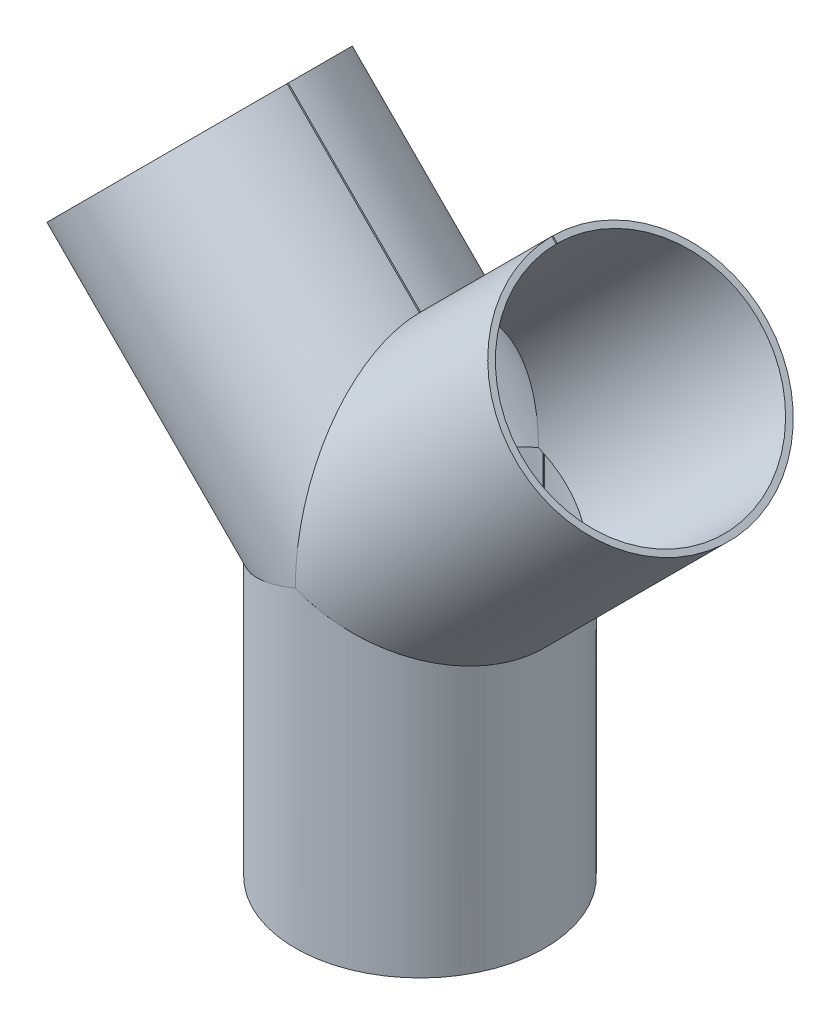
ISO-10303-21;
HEADER;
FILE_DESCRIPTION(('STEP AP214'),'2;1');
FILE_NAME('part.step','',(''),(''),'','','');
FILE_SCHEMA(('AUTOMOTIVE_DESIGN { 1 0 10303 214 1 1 1 1 }'));
ENDSEC;
DATA;
#1=APPLICATION_CONTEXT('core data for automotive mechanical design processes');
#2=APPLICATION_PROTOCOL_DEFINITION('international standard','automotive_design',2000,#1);
#3=PRODUCT_CONTEXT('',#1,'mechanical');
#4=PRODUCT('Part','Part','',(#3));
#5=PRODUCT_RELATED_PRODUCT_CATEGORY('part','',(#4));
#6=PRODUCT_DEFINITION_FORMATION('','',#4);
#7=PRODUCT_DEFINITION_CONTEXT('part definition',#1,'design');
#8=PRODUCT_DEFINITION('design','',#6,#7);
#9=PRODUCT_DEFINITION_SHAPE('','',#8);
#10=(LENGTH_UNIT() NAMED_UNIT(*) SI_UNIT(.MILLI.,.METRE.));
#11=(NAMED_UNIT(*) PLANE_ANGLE_UNIT() SI_UNIT($,.RADIAN.));
#12=(NAMED_UNIT(*) SI_UNIT($,.STERADIAN.) SOLID_ANGLE_UNIT());
#13=UNCERTAINTY_MEASURE_WITH_UNIT(LENGTH_MEASURE(1.E-05),#10,'distance_accuracy_value','');
#14=(GEOMETRIC_REPRESENTATION_CONTEXT(3) GLOBAL_UNCERTAINTY_ASSIGNED_CONTEXT((#13)) GLOBAL_UNIT_ASSIGNED_CONTEXT((#10,
#11,#12)) REPRESENTATION_CONTEXT('',''));
#15=CARTESIAN_POINT('',(0.,0.,0.));
#16=DIRECTION('',(0.,0.,1.));
#17=DIRECTION('',(1.,0.,0.));
#18=AXIS2_PLACEMENT_3D('',#15,#16,#17);
#19=CARTESIAN_POINT('',(0.,0.,0.));
#20=DIRECTION('',(0.,-1.,0.));
#21=DIRECTION('',(1.,0.,0.));
#22=AXIS2_PLACEMENT_3D('',#19,#20,#21);
#23=CYLINDRICAL_SURFACE('',#22,200.);
#24=CARTESIAN_POINT('',(0.,0.,0.));
#25=DIRECTION('',(-0.382683432365084,-0.923879532511289,0.));
#26=DIRECTION('',(0.923879532511289,-0.382683432365084,0.));
#27=AXIS2_PLACEMENT_3D('',#24,#25,#26);
#28=ELLIPSE('',#27,216.478440058478,200.);
#29=CARTESIAN_POINT('',(0.999996874994865,-0.414212267953578,-199.9975));
#30=VERTEX_POINT('',#29);
#31=CARTESIAN_POINT('',(0.,0.,200.));
#32=VERTEX_POINT('',#31);
#33=EDGE_CURVE('E135',#30,#32,#28,.T.);
#34=ORIENTED_EDGE('',*,*,#33,.T.);
#35=CARTESIAN_POINT('',(0.,0.,0.));
#36=DIRECTION('',(0.382683432365084,-0.923879532511289,0.));
#37=DIRECTION('',(-0.923879532511289,-0.382683432365084,0.));
#38=AXIS2_PLACEMENT_3D('',#35,#36,#37);
#39=ELLIPSE('',#38,216.478440058478,200.);
#40=CARTESIAN_POINT('',(-0.999996874995147,-0.414212267953695,-199.9975));
#41=VERTEX_POINT('',#40);
#42=EDGE_CURVE('E138',#32,#41,#39,.T.);
#43=ORIENTED_EDGE('',*,*,#42,.T.);
#44=DIRECTION('',(0.,-1.,0.));
#45=VECTOR('',#44,1.);
#46=CARTESIAN_POINT('',(-0.999996874995147,0.,-199.9975));
#47=LINE('',#46,#45);
#48=CARTESIAN_POINT('',(-0.999996874995055,-500.,-199.9975));
#49=VERTEX_POINT('',#48);
#50=EDGE_CURVE('E102',#41,#49,#47,.T.);
#51=ORIENTED_EDGE('',*,*,#50,.T.);
#52=CARTESIAN_POINT('',(0.,-500.,0.));
#53=DIRECTION('',(0.,1.,0.));
#54=DIRECTION('',(-1.,0.,0.));
#55=AXIS2_PLACEMENT_3D('',#52,#53,#54);
#56=CIRCLE('',#55,200.);
#57=CARTESIAN_POINT('',(0.999996874994957,-500.,-199.9975));
#58=VERTEX_POINT('',#57);
#59=EDGE_CURVE('E151',#49,#58,#56,.T.);
#60=ORIENTED_EDGE('',*,*,#59,.T.);
#61=DIRECTION('',(0.,-1.,0.));
#62=VECTOR('',#61,1.);
#63=CARTESIAN_POINT('',(0.999996874994865,0.,-199.9975));
#64=LINE('',#63,#62);
#65=EDGE_CURVE('E95',#30,#58,#64,.T.);
#66=ORIENTED_EDGE('',*,*,#65,.F.);
#67=EDGE_LOOP('',(#34,#43,#51,#60,#66));
#68=FACE_BOUND('',#67,.T.);
#69=ADVANCED_FACE('F88',(#68),#23,.T.);
#70=CARTESIAN_POINT('',(0.992496898432423,0.,-198.49751875));
#71=DIRECTION('',(-0.9999875,0.,-0.00499998437496119));
#72=DIRECTION('',(-0.00499998437496119,0.,0.9999875));
#73=AXIS2_PLACEMENT_3D('',#70,#71,#72);
#74=PLANE('',#73);
#75=DIRECTION('',(-0.00499997365179152,0.00207105689808014,0.999985355386171));
#76=VECTOR('',#75,1.);
#77=CARTESIAN_POINT('',(0.992492641338627,-0.411103912597948,-198.496667339223));
#78=LINE('',#77,#76);
#79=CARTESIAN_POINT('',(0.992496898432423,-0.411105675943934,-198.49751875));
#80=VERTEX_POINT('',#79);
#81=EDGE_CURVE('E143',#30,#80,#78,.T.);
#82=ORIENTED_EDGE('',*,*,#81,.F.);
#83=ORIENTED_EDGE('',*,*,#65,.T.);
#84=DIRECTION('',(0.00499998437496119,0.,-0.9999875));
#85=VECTOR('',#84,1.);
#86=CARTESIAN_POINT('',(0.992496898432515,-500.,-198.49751875));
#87=LINE('',#86,#85);
#88=CARTESIAN_POINT('',(0.992496898432515,-500.,-198.49751875));
#89=VERTEX_POINT('',#88);
#90=EDGE_CURVE('E154',#89,#58,#87,.T.);
#91=ORIENTED_EDGE('',*,*,#90,.F.);
#92=DIRECTION('',(0.,-1.,0.));
#93=VECTOR('',#92,1.);
#94=CARTESIAN_POINT('',(0.992496898432423,0.,-198.49751875));
#95=LINE('',#94,#93);
#96=EDGE_CURVE('E169',#80,#89,#95,.T.);
#97=ORIENTED_EDGE('',*,*,#96,.F.);
#98=EDGE_LOOP('',(#82,#83,#91,#97));
#99=FACE_BOUND('',#98,.T.);
#100=ADVANCED_FACE('F172',(#99),#74,.T.);
#101=CARTESIAN_POINT('',(0.,0.,0.));
#102=DIRECTION('',(0.,-1.,0.));
#103=DIRECTION('',(1.,0.,0.));
#104=AXIS2_PLACEMENT_3D('',#101,#102,#103);
#105=CYLINDRICAL_SURFACE('',#104,198.5);
#106=CARTESIAN_POINT('',(0.,0.,0.));
#107=DIRECTION('',(-0.382683432365084,-0.923879532511289,0.));
#108=DIRECTION('',(0.923879532511289,-0.382683432365084,0.));
#109=AXIS2_PLACEMENT_3D('',#106,#107,#108);
#110=ELLIPSE('',#109,214.85485175804,198.5);
#111=CARTESIAN_POINT('',(0.,0.,198.5));
#112=VERTEX_POINT('',#111);
#113=EDGE_CURVE('E147',#80,#112,#110,.T.);
#114=ORIENTED_EDGE('',*,*,#113,.F.);
#115=ORIENTED_EDGE('',*,*,#96,.T.);
#116=CARTESIAN_POINT('',(0.,-500.,0.));
#117=DIRECTION('',(0.,1.,0.));
#118=DIRECTION('',(1.,0.,0.));
#119=AXIS2_PLACEMENT_3D('',#116,#117,#118);
#120=CIRCLE('',#119,198.5);
#121=CARTESIAN_POINT('',(-0.992496898432571,-500.,-198.49751875));
#122=VERTEX_POINT('',#121);
#123=EDGE_CURVE('E161',#122,#89,#120,.T.);
#124=ORIENTED_EDGE('',*,*,#123,.F.);
#125=DIRECTION('',(0.,-1.,0.));
#126=VECTOR('',#125,1.);
#127=CARTESIAN_POINT('',(-0.992496898432663,0.,-198.49751875));
#128=LINE('',#127,#126);
#129=CARTESIAN_POINT('',(-0.992496898432663,-0.411105675944034,-198.49751875));
#130=VERTEX_POINT('',#129);
#131=EDGE_CURVE('E110',#130,#122,#128,.T.);
#132=ORIENTED_EDGE('',*,*,#131,.F.);
#133=CARTESIAN_POINT('',(0.,0.,0.));
#134=DIRECTION('',(0.382683432365084,-0.923879532511289,0.));
#135=DIRECTION('',(-0.923879532511289,-0.382683432365084,0.));
#136=AXIS2_PLACEMENT_3D('',#133,#134,#135);
#137=ELLIPSE('',#136,214.85485175804,198.5);
#138=EDGE_CURVE('E152',#112,#130,#137,.T.);
#139=ORIENTED_EDGE('',*,*,#138,.F.);
#140=EDGE_LOOP('',(#114,#115,#124,#132,#139));
#141=FACE_BOUND('',#140,.T.);
#142=ADVANCED_FACE('F177',(#141),#105,.F.);
#143=CARTESIAN_POINT('',(-0.999996874995147,0.,-199.9975));
#144=DIRECTION('',(0.9999875,0.,-0.0049999843749888));
#145=DIRECTION('',(-0.0049999843749888,0.,-0.9999875));
#146=AXIS2_PLACEMENT_3D('',#143,#144,#145);
#147=PLANE('',#146);
#148=DIRECTION('',(-0.00499997365181913,-0.00207105689809158,-0.999985355386171));
#149=VECTOR('',#148,1.);
#150=CARTESIAN_POINT('',(-0.999992585731875,-0.414210491282676,-199.996642155388));
#151=LINE('',#150,#149);
#152=EDGE_CURVE('E142',#130,#41,#151,.T.);
#153=ORIENTED_EDGE('',*,*,#152,.F.);
#154=ORIENTED_EDGE('',*,*,#131,.T.);
#155=DIRECTION('',(0.0049999843749888,0.,0.9999875));
#156=VECTOR('',#155,1.);
#157=CARTESIAN_POINT('',(-0.999996874995055,-500.,-199.9975));
#158=LINE('',#157,#156);
#159=EDGE_CURVE('E164',#49,#122,#158,.T.);
#160=ORIENTED_EDGE('',*,*,#159,.F.);
#161=ORIENTED_EDGE('',*,*,#50,.F.);
#162=EDGE_LOOP('',(#153,#154,#160,#161));
#163=FACE_BOUND('',#162,.T.);
#164=ADVANCED_FACE('F180',(#163),#147,.T.);
#165=CARTESIAN_POINT('',(0.,-500.,0.));
#166=DIRECTION('',(0.,1.,0.));
#167=DIRECTION('',(1.,0.,0.));
#168=AXIS2_PLACEMENT_3D('',#165,#166,#167);
#169=PLANE('',#168);
#170=ORIENTED_EDGE('',*,*,#59,.F.);
#171=ORIENTED_EDGE('',*,*,#159,.T.);
#172=ORIENTED_EDGE('',*,*,#123,.T.);
#173=ORIENTED_EDGE('',*,*,#90,.T.);
#174=EDGE_LOOP('',(#170,#171,#172,#173));
#175=FACE_BOUND('',#174,.T.);
#176=ADVANCED_FACE('F175',(#175),#169,.F.);
#177=CARTESIAN_POINT('',(0.,0.,-200.));
#178=DIRECTION('',(0.382683432365084,-0.923879532511289,0.));
#179=DIRECTION('',(0.923879532511289,0.382683432365084,0.));
#180=AXIS2_PLACEMENT_3D('',#177,#178,#179);
#181=PLANE('',#180);
#182=DIRECTION('',(0.,0.,-1.));
#183=VECTOR('',#182,1.);
#184=CARTESIAN_POINT('',(0.,0.,0.));
#185=LINE('',#184,#183);
#186=EDGE_CURVE('E13',#32,#112,#185,.T.);
#187=ORIENTED_EDGE('',*,*,#186,.T.);
#188=ORIENTED_EDGE('',*,*,#138,.T.);
#189=ORIENTED_EDGE('',*,*,#152,.T.);
#190=ORIENTED_EDGE('',*,*,#42,.F.);
#191=EDGE_LOOP('',(#187,#188,#189,#190));
#192=FACE_BOUND('',#191,.T.);
#193=ADVANCED_FACE('F150',(#192),#181,.F.);
#194=CARTESIAN_POINT('',(0.,0.,-200.));
#195=DIRECTION('',(-0.382683432365084,-0.923879532511289,0.));
#196=DIRECTION('',(0.923879532511289,-0.382683432365084,0.));
#197=AXIS2_PLACEMENT_3D('',#194,#195,#196);
#198=PLANE('',#197);
#199=ORIENTED_EDGE('',*,*,#33,.F.);
#200=ORIENTED_EDGE('',*,*,#81,.T.);
#201=ORIENTED_EDGE('',*,*,#113,.T.);
#202=ORIENTED_EDGE('',*,*,#186,.F.);
#203=EDGE_LOOP('',(#199,#200,#201,#202));
#204=FACE_BOUND('',#203,.T.);
#205=ADVANCED_FACE('F145',(#204),#198,.F.);
#206=CLOSED_SHELL('',(#69,#100,#142,#164,#176,#193,#205));
#207=MANIFOLD_SOLID_BREP('B2',#206);
#208=CARTESIAN_POINT('',(-1.11022302462516E-13,0.,0.));
#209=DIRECTION('',(-0.707106781186549,0.707106781186546,0.));
#210=DIRECTION('',(-0.707106781186546,-0.707106781186549,0.));
#211=AXIS2_PLACEMENT_3D('',#208,#209,#210);
#212=CYLINDRICAL_SURFACE('',#211,200.);
#213=CARTESIAN_POINT('',(0.,0.,0.));
#214=DIRECTION('',(-1.,0.,0.));
#215=DIRECTION('',(0.,1.,0.));
#216=AXIS2_PLACEMENT_3D('',#213,#214,#215);
#217=ELLIPSE('',#216,282.842712474619,200.);
#218=CARTESIAN_POINT('',(0.,282.839176940713,0.9999968749952));
#219=VERTEX_POINT('',#218);
#220=CARTESIAN_POINT('',(0.,0.,200.));
#221=VERTEX_POINT('',#220);
#222=EDGE_CURVE('E327',#219,#221,#217,.F.);
#223=ORIENTED_EDGE('',*,*,#222,.F.);
#224=DIRECTION('',(-0.707106781186549,0.707106781186546,0.));
#225=VECTOR('',#224,1.);
#226=CARTESIAN_POINT('',(141.419588470356,141.419588470357,0.999996874995208));
#227=LINE('',#226,#225);
#228=CARTESIAN_POINT('',(-212.133802122918,494.97297906363,0.999996874995208));
#229=VERTEX_POINT('',#228);
#230=EDGE_CURVE('E342',#219,#229,#227,.T.);
#231=ORIENTED_EDGE('',*,*,#230,.T.);
#232=CARTESIAN_POINT('',(-353.553390593275,353.553390593273,0.));
#233=DIRECTION('',(-0.707106781186549,0.707106781186546,0.));
#234=DIRECTION('',(-0.707106781186546,-0.707106781186549,0.));
#235=AXIS2_PLACEMENT_3D('',#232,#233,#234);
#236=CIRCLE('',#235,200.);
#237=CARTESIAN_POINT('',(-212.133802122918,494.97297906363,-0.99999687499507));
#238=VERTEX_POINT('',#237);
#239=EDGE_CURVE('E329',#238,#229,#236,.T.);
#240=ORIENTED_EDGE('',*,*,#239,.F.);
#241=DIRECTION('',(-0.707106781186549,0.707106781186546,0.));
#242=VECTOR('',#241,1.);
#243=CARTESIAN_POINT('',(141.419588470356,141.419588470357,-0.99999687499507));
#244=LINE('',#243,#242);
#245=CARTESIAN_POINT('',(0.,282.839176940713,-0.999996874995076));
#246=VERTEX_POINT('',#245);
#247=EDGE_CURVE('E264',#246,#238,#244,.T.);
#248=ORIENTED_EDGE('',*,*,#247,.F.);
#249=CARTESIAN_POINT('',(0.,0.,-200.));
#250=VERTEX_POINT('',#249);
#251=EDGE_CURVE('E313',#250,#246,#217,.F.);
#252=ORIENTED_EDGE('',*,*,#251,.F.);
#253=CARTESIAN_POINT('',(0.,0.,0.));
#254=DIRECTION('',(0.382683432365096,-0.923879532511284,0.));
#255=DIRECTION('',(-0.923879532511284,-0.382683432365096,0.));
#256=AXIS2_PLACEMENT_3D('',#253,#254,#255);
#257=ELLIPSE('',#256,216.478440058478,200.);
#258=EDGE_CURVE('E324',#250,#221,#257,.F.);
#259=ORIENTED_EDGE('',*,*,#258,.T.);
#260=EDGE_LOOP('',(#223,#231,#240,#248,#252,#259));
#261=FACE_BOUND('',#260,.T.);
#262=ADVANCED_FACE('F257',(#261),#212,.T.);
#263=CARTESIAN_POINT('',(0.,0.,0.));
#264=DIRECTION('',(-0.707106781186549,0.707106781186546,0.));
#265=DIRECTION('',(-0.707106781186546,-0.707106781186549,0.));
#266=AXIS2_PLACEMENT_3D('',#263,#264,#265);
#267=CYLINDRICAL_SURFACE('',#266,190.);
#268=DIRECTION('',(-0.707106781186549,0.707106781186546,0.));
#269=VECTOR('',#268,1.);
#270=CARTESIAN_POINT('',(134.348609046838,134.348609046839,0.949997031245436));
#271=LINE('',#270,#269);
#272=CARTESIAN_POINT('',(0.,268.697218093677,0.949997031245436));
#273=VERTEX_POINT('',#272);
#274=CARTESIAN_POINT('',(-219.204781546436,487.901999640112,0.949997031245436));
#275=VERTEX_POINT('',#274);
#276=EDGE_CURVE('E345',#273,#275,#271,.T.);
#277=ORIENTED_EDGE('',*,*,#276,.F.);
#278=CARTESIAN_POINT('',(0.,0.,0.));
#279=DIRECTION('',(-1.,0.,0.));
#280=DIRECTION('',(0.,1.,0.));
#281=AXIS2_PLACEMENT_3D('',#278,#279,#280);
#282=ELLIPSE('',#281,268.700576850888,190.);
#283=CARTESIAN_POINT('',(0.,0.,190.));
#284=VERTEX_POINT('',#283);
#285=EDGE_CURVE('E359',#273,#284,#282,.F.);
#286=ORIENTED_EDGE('',*,*,#285,.T.);
#287=CARTESIAN_POINT('',(0.,0.,0.));
#288=DIRECTION('',(0.382683432365096,-0.923879532511284,0.));
#289=DIRECTION('',(-0.923879532511284,-0.382683432365096,0.));
#290=AXIS2_PLACEMENT_3D('',#287,#288,#289);
#291=ELLIPSE('',#290,205.654518055554,190.);
#292=CARTESIAN_POINT('',(0.,0.,-190.));
#293=VERTEX_POINT('',#292);
#294=EDGE_CURVE('E319',#293,#284,#291,.F.);
#295=ORIENTED_EDGE('',*,*,#294,.F.);
#296=CARTESIAN_POINT('',(0.,268.697218093677,-0.949997031245328));
#297=VERTEX_POINT('',#296);
#298=EDGE_CURVE('E314',#293,#297,#282,.F.);
#299=ORIENTED_EDGE('',*,*,#298,.T.);
#300=DIRECTION('',(-0.707106781186549,0.707106781186546,0.));
#301=VECTOR('',#300,1.);
#302=CARTESIAN_POINT('',(134.348609046838,134.348609046839,-0.949997031245328));
#303=LINE('',#302,#301);
#304=CARTESIAN_POINT('',(-219.204781546436,487.901999640112,-0.949997031245328));
#305=VERTEX_POINT('',#304);
#306=EDGE_CURVE('E278',#297,#305,#303,.T.);
#307=ORIENTED_EDGE('',*,*,#306,.T.);
#308=CARTESIAN_POINT('',(-353.553390593274,353.553390593273,0.));
#309=DIRECTION('',(-0.707106781186549,0.707106781186546,0.));
#310=DIRECTION('',(0.,0.,1.));
#311=AXIS2_PLACEMENT_3D('',#308,#309,#310);
#312=CIRCLE('',#311,190.);
#313=EDGE_CURVE('E338',#305,#275,#312,.T.);
#314=ORIENTED_EDGE('',*,*,#313,.T.);
#315=EDGE_LOOP('',(#277,#286,#295,#299,#307,#314));
#316=FACE_BOUND('',#315,.T.);
#317=ADVANCED_FACE('F364',(#316),#267,.F.);
#318=CARTESIAN_POINT('',(141.419588470356,141.419588470357,-0.99999687499507));
#319=DIRECTION('',(-0.00353552285737103,-0.00353552285737104,-0.9999875));
#320=DIRECTION('',(0.,0.999993749941406,-0.00353554495445795));
#321=AXIS2_PLACEMENT_3D('',#318,#319,#320);
#322=PLANE('',#321);
#323=ORIENTED_EDGE('',*,*,#306,.F.);
#324=DIRECTION('',(0.,0.999993749941406,-0.00353554495445795));
#325=VECTOR('',#324,1.);
#326=CARTESIAN_POINT('',(0.,141.421356226261,-0.500004687517184));
#327=LINE('',#326,#325);
#328=EDGE_CURVE('E356',#297,#246,#327,.T.);
#329=ORIENTED_EDGE('',*,*,#328,.T.);
#330=ORIENTED_EDGE('',*,*,#247,.T.);
#331=DIRECTION('',(-0.707097942351781,-0.707097942351784,0.0049999843749742));
#332=VECTOR('',#331,1.);
#333=CARTESIAN_POINT('',(-212.133802122918,494.97297906363,-0.99999687499507));
#334=LINE('',#333,#332);
#335=EDGE_CURVE('E340',#238,#305,#334,.T.);
#336=ORIENTED_EDGE('',*,*,#335,.T.);
#337=EDGE_LOOP('',(#323,#329,#330,#336));
#338=FACE_BOUND('',#337,.T.);
#339=ADVANCED_FACE('F355',(#338),#322,.F.);
#340=CARTESIAN_POINT('',(134.348609046838,134.348609046839,0.949997031245436));
#341=DIRECTION('',(-0.00353552285737315,-0.00353552285737317,0.9999875));
#342=DIRECTION('',(0.,-0.999993749941406,-0.00353554495446008));
#343=AXIS2_PLACEMENT_3D('',#340,#341,#342);
#344=PLANE('',#343);
#345=ORIENTED_EDGE('',*,*,#230,.F.);
#346=DIRECTION('',(0.,-0.999993749941406,-0.00353554495446008));
#347=VECTOR('',#346,1.);
#348=CARTESIAN_POINT('',(0.,134.350288414948,0.475004453141158));
#349=LINE('',#348,#347);
#350=EDGE_CURVE('E362',#219,#273,#349,.T.);
#351=ORIENTED_EDGE('',*,*,#350,.T.);
#352=ORIENTED_EDGE('',*,*,#276,.T.);
#353=DIRECTION('',(0.707097942351781,0.707097942351784,0.0049999843749772));
#354=VECTOR('',#353,1.);
#355=CARTESIAN_POINT('',(-219.204781546436,487.901999640112,0.949997031245436));
#356=LINE('',#355,#354);
#357=EDGE_CURVE('E332',#275,#229,#356,.T.);
#358=ORIENTED_EDGE('',*,*,#357,.T.);
#359=EDGE_LOOP('',(#345,#351,#352,#358));
#360=FACE_BOUND('',#359,.T.);
#361=ADVANCED_FACE('F350',(#360),#344,.F.);
#362=CARTESIAN_POINT('',(-353.553390593275,353.553390593273,0.));
#363=DIRECTION('',(-0.707106781186549,0.707106781186546,0.));
#364=DIRECTION('',(0.,0.,1.));
#365=AXIS2_PLACEMENT_3D('',#362,#363,#364);
#366=PLANE('',#365);
#367=ORIENTED_EDGE('',*,*,#239,.T.);
#368=ORIENTED_EDGE('',*,*,#357,.F.);
#369=ORIENTED_EDGE('',*,*,#313,.F.);
#370=ORIENTED_EDGE('',*,*,#335,.F.);
#371=EDGE_LOOP('',(#367,#368,#369,#370));
#372=FACE_BOUND('',#371,.T.);
#373=ADVANCED_FACE('F354',(#372),#366,.T.);
#374=CARTESIAN_POINT('',(0.,0.,-200.));
#375=DIRECTION('',(0.382683432365096,-0.923879532511284,0.));
#376=DIRECTION('',(0.923879532511284,0.382683432365096,0.));
#377=AXIS2_PLACEMENT_3D('',#374,#375,#376);
#378=PLANE('',#377);
#379=ORIENTED_EDGE('',*,*,#258,.F.);
#380=DIRECTION('',(0.,0.,1.));
#381=VECTOR('',#380,1.);
#382=CARTESIAN_POINT('',(0.,0.,-200.));
#383=LINE('',#382,#381);
#384=EDGE_CURVE('E310',#250,#293,#383,.T.);
#385=ORIENTED_EDGE('',*,*,#384,.T.);
#386=ORIENTED_EDGE('',*,*,#294,.T.);
#387=DIRECTION('',(0.,0.,1.));
#388=VECTOR('',#387,1.);
#389=CARTESIAN_POINT('',(-1.11022302462516E-13,0.,0.));
#390=LINE('',#389,#388);
#391=EDGE_CURVE('E86',#284,#221,#390,.T.);
#392=ORIENTED_EDGE('',*,*,#391,.T.);
#393=EDGE_LOOP('',(#379,#385,#386,#392));
#394=FACE_BOUND('',#393,.T.);
#395=ADVANCED_FACE('F328',(#394),#378,.T.);
#396=CARTESIAN_POINT('',(0.,0.,-200.));
#397=DIRECTION('',(-1.,0.,0.));
#398=DIRECTION('',(0.,0.,1.));
#399=AXIS2_PLACEMENT_3D('',#396,#397,#398);
#400=PLANE('',#399);
#401=ORIENTED_EDGE('',*,*,#251,.T.);
#402=ORIENTED_EDGE('',*,*,#328,.F.);
#403=ORIENTED_EDGE('',*,*,#298,.F.);
#404=ORIENTED_EDGE('',*,*,#384,.F.);
#405=EDGE_LOOP('',(#401,#402,#403,#404));
#406=FACE_BOUND('',#405,.T.);
#407=ADVANCED_FACE('F312',(#406),#400,.F.);
#408=ORIENTED_EDGE('',*,*,#222,.T.);
#409=ORIENTED_EDGE('',*,*,#391,.F.);
#410=ORIENTED_EDGE('',*,*,#285,.F.);
#411=ORIENTED_EDGE('',*,*,#350,.F.);
#412=EDGE_LOOP('',(#408,#409,#410,#411));
#413=FACE_BOUND('',#412,.T.);
#414=ADVANCED_FACE('F365',(#413),#400,.F.);
#415=CLOSED_SHELL('',(#262,#317,#339,#361,#373,#395,#407,#414));
#416=MANIFOLD_SOLID_BREP('B7',#415);
#417=CARTESIAN_POINT('',(0.,0.,0.));
#418=DIRECTION('',(0.707106781186546,0.707106781186549,0.));
#419=DIRECTION('',(-0.707106781186549,0.707106781186546,0.));
#420=AXIS2_PLACEMENT_3D('',#417,#418,#419);
#421=CYLINDRICAL_SURFACE('',#420,200.);
#422=DIRECTION('',(0.707106781186546,0.707106781186549,0.));
#423=VECTOR('',#422,1.);
#424=CARTESIAN_POINT('',(-141.419588470357,141.419588470356,0.999996874995142));
#425=LINE('',#424,#423);
#426=CARTESIAN_POINT('',(0.,282.839176940713,0.999996874995135));
#427=VERTEX_POINT('',#426);
#428=CARTESIAN_POINT('',(212.133802122916,494.972979063631,0.999996874995142));
#429=VERTEX_POINT('',#428);
#430=EDGE_CURVE('E447',#427,#429,#425,.T.);
#431=ORIENTED_EDGE('',*,*,#430,.F.);
#432=CARTESIAN_POINT('',(0.,0.,0.));
#433=DIRECTION('',(-1.,0.,0.));
#434=DIRECTION('',(0.,1.,0.));
#435=AXIS2_PLACEMENT_3D('',#432,#433,#434);
#436=ELLIPSE('',#435,282.84271247462,200.);
#437=CARTESIAN_POINT('',(0.,0.,200.));
#438=VERTEX_POINT('',#437);
#439=EDGE_CURVE('E494',#427,#438,#436,.F.);
#440=ORIENTED_EDGE('',*,*,#439,.T.);
#441=CARTESIAN_POINT('',(0.,0.,0.));
#442=DIRECTION('',(0.382683432365094,0.923879532511285,0.));
#443=DIRECTION('',(0.923879532511285,-0.382683432365094,0.));
#444=AXIS2_PLACEMENT_3D('',#441,#442,#443);
#445=ELLIPSE('',#444,216.478440058478,200.);
#446=CARTESIAN_POINT('',(0.,0.,-200.));
#447=VERTEX_POINT('',#446);
#448=EDGE_CURVE('E503',#447,#438,#445,.F.);
#449=ORIENTED_EDGE('',*,*,#448,.F.);
#450=CARTESIAN_POINT('',(0.,282.839176940713,-0.999996874995052));
#451=VERTEX_POINT('',#450);
#452=EDGE_CURVE('E509',#447,#451,#436,.F.);
#453=ORIENTED_EDGE('',*,*,#452,.T.);
#454=DIRECTION('',(0.707106781186546,0.707106781186549,0.));
#455=VECTOR('',#454,1.);
#456=CARTESIAN_POINT('',(-141.419588470357,141.419588470356,-0.999996874995055));
#457=LINE('',#456,#455);
#458=CARTESIAN_POINT('',(212.133802122916,494.972979063631,-0.999996874995055));
#459=VERTEX_POINT('',#458);
#460=EDGE_CURVE('E526',#451,#459,#457,.T.);
#461=ORIENTED_EDGE('',*,*,#460,.T.);
#462=CARTESIAN_POINT('',(353.553390593273,353.553390593274,0.));
#463=DIRECTION('',(0.707106781186546,0.707106781186549,0.));
#464=DIRECTION('',(-0.707106781186549,0.707106781186546,0.));
#465=AXIS2_PLACEMENT_3D('',#462,#463,#464);
#466=CIRCLE('',#465,200.);
#467=EDGE_CURVE('E511',#429,#459,#466,.T.);
#468=ORIENTED_EDGE('',*,*,#467,.F.);
#469=EDGE_LOOP('',(#431,#440,#449,#453,#461,#468));
#470=FACE_BOUND('',#469,.T.);
#471=ADVANCED_FACE('F440',(#470),#421,.T.);
#472=CARTESIAN_POINT('',(-141.419588470357,141.419588470356,0.999996874995142));
#473=DIRECTION('',(0.00353552285737691,-0.0035355228573769,0.9999875));
#474=DIRECTION('',(0.999993749941406,0.,-0.00353554495446382));
#475=AXIS2_PLACEMENT_3D('',#472,#473,#474);
#476=PLANE('',#475);
#477=DIRECTION('',(0.,-0.999993749941406,-0.00353554495446381));
#478=VECTOR('',#477,1.);
#479=CARTESIAN_POINT('',(0.,141.421356226261,0.500004687516422));
#480=LINE('',#479,#478);
#481=CARTESIAN_POINT('',(0.,268.697218093678,0.949997031245317));
#482=VERTEX_POINT('',#481);
#483=EDGE_CURVE('E507',#427,#482,#480,.T.);
#484=ORIENTED_EDGE('',*,*,#483,.F.);
#485=ORIENTED_EDGE('',*,*,#430,.T.);
#486=DIRECTION('',(0.707097942351784,-0.707097942351782,-0.00499998437498249));
#487=VECTOR('',#486,1.);
#488=CARTESIAN_POINT('',(212.133802122916,494.972979063631,0.999996874995142));
#489=LINE('',#488,#487);
#490=CARTESIAN_POINT('',(219.204781546434,487.901999640113,0.949997031245317));
#491=VERTEX_POINT('',#490);
#492=EDGE_CURVE('E524',#429,#491,#489,.T.);
#493=ORIENTED_EDGE('',*,*,#492,.T.);
#494=DIRECTION('',(0.707106781186546,0.707106781186549,0.));
#495=VECTOR('',#494,1.);
#496=CARTESIAN_POINT('',(-134.348609046839,134.348609046838,0.949997031245317));
#497=LINE('',#496,#495);
#498=EDGE_CURVE('E461',#482,#491,#497,.T.);
#499=ORIENTED_EDGE('',*,*,#498,.F.);
#500=EDGE_LOOP('',(#484,#485,#493,#499));
#501=FACE_BOUND('',#500,.T.);
#502=ADVANCED_FACE('F539',(#501),#476,.F.);
#503=CARTESIAN_POINT('',(0.,0.,0.));
#504=DIRECTION('',(0.707106781186546,0.707106781186549,0.));
#505=DIRECTION('',(-0.707106781186549,0.707106781186546,0.));
#506=AXIS2_PLACEMENT_3D('',#503,#504,#505);
#507=CYLINDRICAL_SURFACE('',#506,190.);
#508=CARTESIAN_POINT('',(0.,0.,0.));
#509=DIRECTION('',(-1.,0.,0.));
#510=DIRECTION('',(0.,1.,0.));
#511=AXIS2_PLACEMENT_3D('',#508,#509,#510);
#512=ELLIPSE('',#511,268.700576850889,190.);
#513=CARTESIAN_POINT('',(0.,0.,190.));
#514=VERTEX_POINT('',#513);
#515=EDGE_CURVE('E495',#482,#514,#512,.F.);
#516=ORIENTED_EDGE('',*,*,#515,.F.);
#517=ORIENTED_EDGE('',*,*,#498,.T.);
#518=CARTESIAN_POINT('',(353.553390593273,353.553390593274,0.));
#519=DIRECTION('',(0.707106781186546,0.707106781186549,0.));
#520=DIRECTION('',(0.707106781186549,-0.707106781186546,0.));
#521=AXIS2_PLACEMENT_3D('',#518,#519,#520);
#522=CIRCLE('',#521,190.);
#523=CARTESIAN_POINT('',(219.204781546434,487.901999640113,-0.949997031245279));
#524=VERTEX_POINT('',#523);
#525=EDGE_CURVE('E522',#491,#524,#522,.T.);
#526=ORIENTED_EDGE('',*,*,#525,.T.);
#527=DIRECTION('',(0.707106781186546,0.707106781186549,0.));
#528=VECTOR('',#527,1.);
#529=CARTESIAN_POINT('',(-134.348609046839,134.348609046838,-0.949997031245279));
#530=LINE('',#529,#528);
#531=CARTESIAN_POINT('',(0.,268.697218093678,-0.949997031245279));
#532=VERTEX_POINT('',#531);
#533=EDGE_CURVE('E529',#532,#524,#530,.T.);
#534=ORIENTED_EDGE('',*,*,#533,.F.);
#535=CARTESIAN_POINT('',(0.,0.,-190.));
#536=VERTEX_POINT('',#535);
#537=EDGE_CURVE('E542',#536,#532,#512,.F.);
#538=ORIENTED_EDGE('',*,*,#537,.F.);
#539=CARTESIAN_POINT('',(0.,0.,0.));
#540=DIRECTION('',(0.382683432365094,0.923879532511285,0.));
#541=DIRECTION('',(0.923879532511285,-0.382683432365094,0.));
#542=AXIS2_PLACEMENT_3D('',#539,#540,#541);
#543=ELLIPSE('',#542,205.654518055554,190.);
#544=EDGE_CURVE('E512',#536,#514,#543,.F.);
#545=ORIENTED_EDGE('',*,*,#544,.T.);
#546=EDGE_LOOP('',(#516,#517,#526,#534,#538,#545));
#547=FACE_BOUND('',#546,.T.);
#548=ADVANCED_FACE('F546',(#547),#507,.F.);
#549=CARTESIAN_POINT('',(-134.348609046839,134.348609046838,-0.949997031245279));
#550=DIRECTION('',(0.00353552285737346,-0.00353552285737345,-0.9999875));
#551=DIRECTION('',(-0.999993749941406,0.,-0.00353554495446037));
#552=AXIS2_PLACEMENT_3D('',#549,#550,#551);
#553=PLANE('',#552);
#554=DIRECTION('',(0.,0.999993749941406,-0.00353554495446036));
#555=VECTOR('',#554,1.);
#556=CARTESIAN_POINT('',(0.,134.350288414948,-0.475004453140958));
#557=LINE('',#556,#555);
#558=EDGE_CURVE('E547',#532,#451,#557,.T.);
#559=ORIENTED_EDGE('',*,*,#558,.F.);
#560=ORIENTED_EDGE('',*,*,#533,.T.);
#561=DIRECTION('',(-0.707097942351784,0.707097942351782,-0.00499998437497761));
#562=VECTOR('',#561,1.);
#563=CARTESIAN_POINT('',(219.204781546434,487.901999640113,-0.949997031245279));
#564=LINE('',#563,#562);
#565=EDGE_CURVE('E515',#524,#459,#564,.T.);
#566=ORIENTED_EDGE('',*,*,#565,.T.);
#567=ORIENTED_EDGE('',*,*,#460,.F.);
#568=EDGE_LOOP('',(#559,#560,#566,#567));
#569=FACE_BOUND('',#568,.T.);
#570=ADVANCED_FACE('F534',(#569),#553,.F.);
#571=CARTESIAN_POINT('',(353.553390593273,353.553390593274,0.));
#572=DIRECTION('',(0.707106781186546,0.707106781186549,0.));
#573=DIRECTION('',(0.707106781186549,-0.707106781186546,0.));
#574=AXIS2_PLACEMENT_3D('',#571,#572,#573);
#575=PLANE('',#574);
#576=ORIENTED_EDGE('',*,*,#467,.T.);
#577=ORIENTED_EDGE('',*,*,#565,.F.);
#578=ORIENTED_EDGE('',*,*,#525,.F.);
#579=ORIENTED_EDGE('',*,*,#492,.F.);
#580=EDGE_LOOP('',(#576,#577,#578,#579));
#581=FACE_BOUND('',#580,.T.);
#582=ADVANCED_FACE('F538',(#581),#575,.T.);
#583=CARTESIAN_POINT('',(0.,0.,-200.));
#584=DIRECTION('',(0.382683432365094,0.923879532511285,0.));
#585=DIRECTION('',(-0.923879532511285,0.382683432365094,0.));
#586=AXIS2_PLACEMENT_3D('',#583,#584,#585);
#587=PLANE('',#586);
#588=ORIENTED_EDGE('',*,*,#448,.T.);
#589=DIRECTION('',(0.,0.,1.));
#590=VECTOR('',#589,1.);
#591=CARTESIAN_POINT('',(0.,0.,0.));
#592=LINE('',#591,#590);
#593=EDGE_CURVE('E255',#514,#438,#592,.T.);
#594=ORIENTED_EDGE('',*,*,#593,.F.);
#595=ORIENTED_EDGE('',*,*,#544,.F.);
#596=DIRECTION('',(0.,0.,1.));
#597=VECTOR('',#596,1.);
#598=CARTESIAN_POINT('',(0.,0.,-200.));
#599=LINE('',#598,#597);
#600=EDGE_CURVE('E506',#447,#536,#599,.T.);
#601=ORIENTED_EDGE('',*,*,#600,.F.);
#602=EDGE_LOOP('',(#588,#594,#595,#601));
#603=FACE_BOUND('',#602,.T.);
#604=ADVANCED_FACE('F510',(#603),#587,.F.);
#605=CARTESIAN_POINT('',(0.,0.,-200.));
#606=DIRECTION('',(-1.,0.,0.));
#607=DIRECTION('',(0.,0.,1.));
#608=AXIS2_PLACEMENT_3D('',#605,#606,#607);
#609=PLANE('',#608);
#610=ORIENTED_EDGE('',*,*,#600,.T.);
#611=ORIENTED_EDGE('',*,*,#537,.T.);
#612=ORIENTED_EDGE('',*,*,#558,.T.);
#613=ORIENTED_EDGE('',*,*,#452,.F.);
#614=EDGE_LOOP('',(#610,#611,#612,#613));
#615=FACE_BOUND('',#614,.T.);
#616=ADVANCED_FACE('F545',(#615),#609,.T.);
#617=ORIENTED_EDGE('',*,*,#483,.T.);
#618=ORIENTED_EDGE('',*,*,#515,.T.);
#619=ORIENTED_EDGE('',*,*,#593,.T.);
#620=ORIENTED_EDGE('',*,*,#439,.F.);
#621=EDGE_LOOP('',(#617,#618,#619,#620));
#622=FACE_BOUND('',#621,.T.);
#623=ADVANCED_FACE('F493',(#622),#609,.T.);
#624=CLOSED_SHELL('',(#471,#502,#548,#570,#582,#604,#616,#623));
#625=MANIFOLD_SOLID_BREP('B80',#624);
#626=ADVANCED_BREP_SHAPE_REPRESENTATION('',(#18,#207,#416,#625),#14);
#627=SHAPE_DEFINITION_REPRESENTATION(#9,#626);
ENDSEC;
END-ISO-10303-21;
